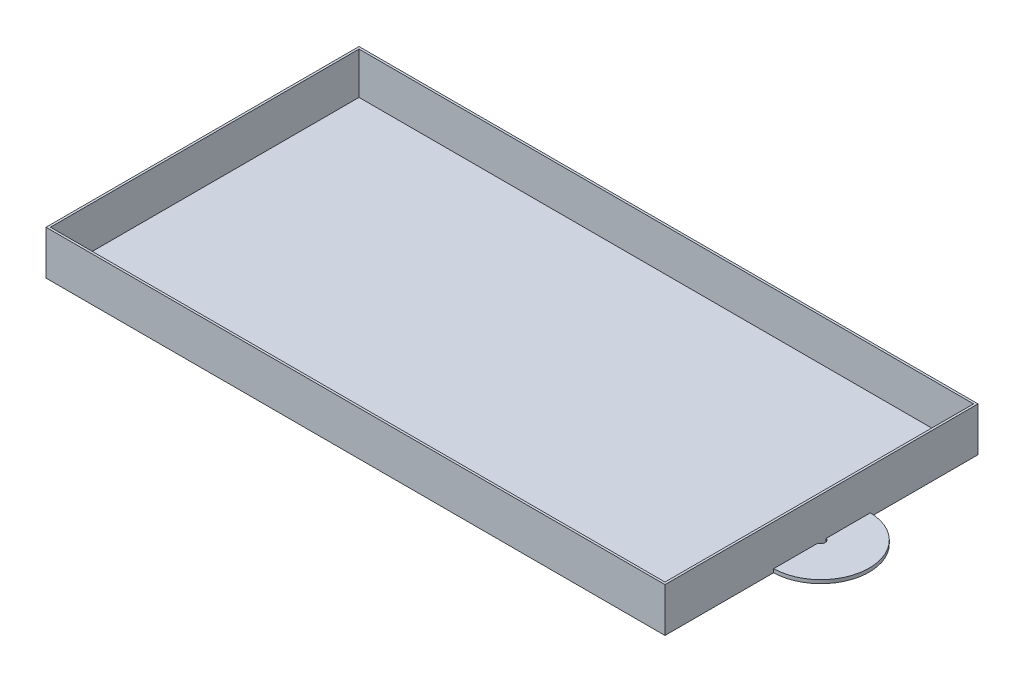
ISO-10303-21;
HEADER;
FILE_DESCRIPTION(('STEP AP214'),'2;1');
FILE_NAME('part.step','',(''),(''),'','','');
FILE_SCHEMA(('AUTOMOTIVE_DESIGN { 1 0 10303 214 1 1 1 1 }'));
ENDSEC;
DATA;
#1=APPLICATION_CONTEXT('core data for automotive mechanical design processes');
#2=APPLICATION_PROTOCOL_DEFINITION('international standard','automotive_design',2000,#1);
#3=PRODUCT_CONTEXT('',#1,'mechanical');
#4=PRODUCT('Part','Part','',(#3));
#5=PRODUCT_RELATED_PRODUCT_CATEGORY('part','',(#4));
#6=PRODUCT_DEFINITION_FORMATION('','',#4);
#7=PRODUCT_DEFINITION_CONTEXT('part definition',#1,'design');
#8=PRODUCT_DEFINITION('design','',#6,#7);
#9=PRODUCT_DEFINITION_SHAPE('','',#8);
#10=(LENGTH_UNIT() NAMED_UNIT(*) SI_UNIT(.MILLI.,.METRE.));
#11=(NAMED_UNIT(*) PLANE_ANGLE_UNIT() SI_UNIT($,.RADIAN.));
#12=(NAMED_UNIT(*) SI_UNIT($,.STERADIAN.) SOLID_ANGLE_UNIT());
#13=UNCERTAINTY_MEASURE_WITH_UNIT(LENGTH_MEASURE(1.E-05),#10,'distance_accuracy_value','');
#14=(GEOMETRIC_REPRESENTATION_CONTEXT(3) GLOBAL_UNCERTAINTY_ASSIGNED_CONTEXT((#13)) GLOBAL_UNIT_ASSIGNED_CONTEXT((#10,
#11,#12)) REPRESENTATION_CONTEXT('',''));
#15=CARTESIAN_POINT('',(0.,0.,0.));
#16=DIRECTION('',(0.,0.,1.));
#17=DIRECTION('',(1.,0.,0.));
#18=AXIS2_PLACEMENT_3D('',#15,#16,#17);
#19=CARTESIAN_POINT('',(0.,10.,-2.60735612147177));
#20=DIRECTION('',(-1.,0.,0.));
#21=DIRECTION('',(0.,0.,1.));
#22=AXIS2_PLACEMENT_3D('',#19,#20,#21);
#23=PLANE('',#22);
#24=DIRECTION('',(0.,-1.,0.));
#25=VECTOR('',#24,1.);
#26=CARTESIAN_POINT('',(0.,0.8,33.7252455357768));
#27=LINE('',#26,#25);
#28=CARTESIAN_POINT('',(0.,0.,33.7252455357768));
#29=VERTEX_POINT('',#28);
#30=CARTESIAN_POINT('',(0.,0.8,33.7252455357768));
#31=VERTEX_POINT('',#30);
#32=EDGE_CURVE('E168',#29,#31,#27,.F.);
#33=ORIENTED_EDGE('',*,*,#32,.F.);
#34=DIRECTION('',(0.,0.,-1.));
#35=VECTOR('',#34,1.);
#36=CARTESIAN_POINT('',(0.,0.,-2.60735612147177));
#37=LINE('',#36,#35);
#38=CARTESIAN_POINT('',(0.,0.,31.8363936925479));
#39=VERTEX_POINT('',#38);
#40=EDGE_CURVE('E137',#29,#39,#37,.T.);
#41=ORIENTED_EDGE('',*,*,#40,.T.);
#42=DIRECTION('',(0.,-1.,0.));
#43=VECTOR('',#42,1.);
#44=CARTESIAN_POINT('',(0.,0.8,31.8363936925479));
#45=LINE('',#44,#43);
#46=CARTESIAN_POINT('',(0.,0.8,31.8363936925479));
#47=VERTEX_POINT('',#46);
#48=EDGE_CURVE('E171',#47,#39,#45,.T.);
#49=ORIENTED_EDGE('',*,*,#48,.F.);
#50=DIRECTION('',(0.,0.,-1.));
#51=VECTOR('',#50,1.);
#52=CARTESIAN_POINT('',(0.,0.8,-2.60735612147177));
#53=LINE('',#52,#51);
#54=CARTESIAN_POINT('',(0.,0.8,21.8067122409734));
#55=VERTEX_POINT('',#54);
#56=EDGE_CURVE('E144',#47,#55,#53,.T.);
#57=ORIENTED_EDGE('',*,*,#56,.T.);
#58=DIRECTION('',(0.,-1.,0.));
#59=VECTOR('',#58,1.);
#60=CARTESIAN_POINT('',(0.,0.8,21.8067122409734));
#61=LINE('',#60,#59);
#62=CARTESIAN_POINT('',(0.,0.,21.8067122409734));
#63=VERTEX_POINT('',#62);
#64=EDGE_CURVE('E142',#55,#63,#61,.T.);
#65=ORIENTED_EDGE('',*,*,#64,.T.);
#66=CARTESIAN_POINT('',(0.,0.,-2.60735612147177));
#67=VERTEX_POINT('',#66);
#68=EDGE_CURVE('E127',#63,#67,#37,.T.);
#69=ORIENTED_EDGE('',*,*,#68,.T.);
#70=DIRECTION('',(0.,-1.,0.));
#71=VECTOR('',#70,1.);
#72=CARTESIAN_POINT('',(0.,10.,-2.60735612147177));
#73=LINE('',#72,#71);
#74=CARTESIAN_POINT('',(0.,10.,-2.60735612147177));
#75=VERTEX_POINT('',#74);
#76=EDGE_CURVE('E11',#75,#67,#73,.T.);
#77=ORIENTED_EDGE('',*,*,#76,.F.);
#78=DIRECTION('',(0.,0.,-1.));
#79=VECTOR('',#78,1.);
#80=CARTESIAN_POINT('',(0.,10.,-2.60735612147177));
#81=LINE('',#80,#79);
#82=CARTESIAN_POINT('',(0.,10.,68.3929567247595));
#83=VERTEX_POINT('',#82);
#84=EDGE_CURVE('E215',#83,#75,#81,.T.);
#85=ORIENTED_EDGE('',*,*,#84,.F.);
#86=DIRECTION('',(0.,-1.,0.));
#87=VECTOR('',#86,1.);
#88=CARTESIAN_POINT('',(0.,10.,68.3929567247595));
#89=LINE('',#88,#87);
#90=CARTESIAN_POINT('',(0.,0.,68.3929567247595));
#91=VERTEX_POINT('',#90);
#92=EDGE_CURVE('E228',#83,#91,#89,.T.);
#93=ORIENTED_EDGE('',*,*,#92,.T.);
#94=CARTESIAN_POINT('',(0.,0.,43.7549269873514));
#95=VERTEX_POINT('',#94);
#96=EDGE_CURVE('E140',#91,#95,#37,.T.);
#97=ORIENTED_EDGE('',*,*,#96,.T.);
#98=DIRECTION('',(0.,-1.,0.));
#99=VECTOR('',#98,1.);
#100=CARTESIAN_POINT('',(0.,0.8,43.7549269873514));
#101=LINE('',#100,#99);
#102=CARTESIAN_POINT('',(0.,0.8,43.7549269873514));
#103=VERTEX_POINT('',#102);
#104=EDGE_CURVE('E59',#103,#95,#101,.T.);
#105=ORIENTED_EDGE('',*,*,#104,.F.);
#106=EDGE_CURVE('E54',#103,#31,#53,.T.);
#107=ORIENTED_EDGE('',*,*,#106,.T.);
#108=EDGE_LOOP('',(#33,#41,#49,#57,#65,#69,#77,#85,#93,#97,#105,#107));
#109=FACE_BOUND('',#108,.T.);
#110=ADVANCED_FACE('F39',(#109),#23,.F.);
#111=CARTESIAN_POINT('',(0.,10.,0.));
#112=DIRECTION('',(0.,-1.,0.));
#113=DIRECTION('',(0.,0.,-1.));
#114=AXIS2_PLACEMENT_3D('',#111,#112,#113);
#115=PLANE('',#114);
#116=ORIENTED_EDGE('',*,*,#84,.T.);
#117=DIRECTION('',(-1.,0.,0.));
#118=VECTOR('',#117,1.);
#119=CARTESIAN_POINT('',(0.,10.,-2.60735612147177));
#120=LINE('',#119,#118);
#121=CARTESIAN_POINT('',(-140.39609884848,10.,-2.60735612147177));
#122=VERTEX_POINT('',#121);
#123=EDGE_CURVE('E219',#75,#122,#120,.T.);
#124=ORIENTED_EDGE('',*,*,#123,.T.);
#125=DIRECTION('',(0.,0.,1.));
#126=VECTOR('',#125,1.);
#127=CARTESIAN_POINT('',(-140.39609884848,10.,-2.60735612147177));
#128=LINE('',#127,#126);
#129=CARTESIAN_POINT('',(-140.39609884848,10.,68.3929567247595));
#130=VERTEX_POINT('',#129);
#131=EDGE_CURVE('E223',#122,#130,#128,.T.);
#132=ORIENTED_EDGE('',*,*,#131,.T.);
#133=DIRECTION('',(1.,0.,0.));
#134=VECTOR('',#133,1.);
#135=CARTESIAN_POINT('',(0.,10.,68.3929567247595));
#136=LINE('',#135,#134);
#137=EDGE_CURVE('E226',#130,#83,#136,.T.);
#138=ORIENTED_EDGE('',*,*,#137,.T.);
#139=EDGE_LOOP('',(#116,#124,#132,#138));
#140=FACE_BOUND('',#139,.T.);
#141=DIRECTION('',(0.,0.,-1.));
#142=VECTOR('',#141,1.);
#143=CARTESIAN_POINT('',(-0.5,10.,0.));
#144=LINE('',#143,#142);
#145=CARTESIAN_POINT('',(-0.5,10.,67.8929567247595));
#146=VERTEX_POINT('',#145);
#147=CARTESIAN_POINT('',(-0.5,10.,-2.10735612147177));
#148=VERTEX_POINT('',#147);
#149=EDGE_CURVE('E203',#146,#148,#144,.T.);
#150=ORIENTED_EDGE('',*,*,#149,.F.);
#151=DIRECTION('',(1.,0.,0.));
#152=VECTOR('',#151,1.);
#153=CARTESIAN_POINT('',(0.,10.,67.8929567247595));
#154=LINE('',#153,#152);
#155=CARTESIAN_POINT('',(-139.89609884848,10.,67.8929567247595));
#156=VERTEX_POINT('',#155);
#157=EDGE_CURVE('E188',#156,#146,#154,.T.);
#158=ORIENTED_EDGE('',*,*,#157,.F.);
#159=DIRECTION('',(0.,0.,1.));
#160=VECTOR('',#159,1.);
#161=CARTESIAN_POINT('',(-139.89609884848,10.,0.));
#162=LINE('',#161,#160);
#163=CARTESIAN_POINT('',(-139.89609884848,10.,-2.10735612147177));
#164=VERTEX_POINT('',#163);
#165=EDGE_CURVE('E209',#164,#156,#162,.T.);
#166=ORIENTED_EDGE('',*,*,#165,.F.);
#167=DIRECTION('',(-1.,0.,0.));
#168=VECTOR('',#167,1.);
#169=CARTESIAN_POINT('',(0.,10.,-2.10735612147177));
#170=LINE('',#169,#168);
#171=EDGE_CURVE('E206',#148,#164,#170,.T.);
#172=ORIENTED_EDGE('',*,*,#171,.F.);
#173=EDGE_LOOP('',(#150,#158,#166,#172));
#174=FACE_BOUND('',#173,.T.);
#175=ADVANCED_FACE('F259',(#140,#174),#115,.F.);
#176=CARTESIAN_POINT('',(0.,10.,-2.60735612147177));
#177=DIRECTION('',(0.,0.,1.));
#178=DIRECTION('',(1.,0.,0.));
#179=AXIS2_PLACEMENT_3D('',#176,#177,#178);
#180=PLANE('',#179);
#181=DIRECTION('',(-1.,0.,0.));
#182=VECTOR('',#181,1.);
#183=CARTESIAN_POINT('',(0.,0.,-2.60735612147177));
#184=LINE('',#183,#182);
#185=CARTESIAN_POINT('',(-140.39609884848,0.,-2.60735612147177));
#186=VERTEX_POINT('',#185);
#187=EDGE_CURVE('E134',#67,#186,#184,.T.);
#188=ORIENTED_EDGE('',*,*,#187,.T.);
#189=DIRECTION('',(0.,-1.,0.));
#190=VECTOR('',#189,1.);
#191=CARTESIAN_POINT('',(-140.39609884848,10.,-2.60735612147177));
#192=LINE('',#191,#190);
#193=EDGE_CURVE('E47',#122,#186,#192,.T.);
#194=ORIENTED_EDGE('',*,*,#193,.F.);
#195=ORIENTED_EDGE('',*,*,#123,.F.);
#196=ORIENTED_EDGE('',*,*,#76,.T.);
#197=EDGE_LOOP('',(#188,#194,#195,#196));
#198=FACE_BOUND('',#197,.T.);
#199=ADVANCED_FACE('F261',(#198),#180,.F.);
#200=CARTESIAN_POINT('',(-140.39609884848,10.,-2.60735612147177));
#201=DIRECTION('',(1.,0.,0.));
#202=DIRECTION('',(0.,0.,-1.));
#203=AXIS2_PLACEMENT_3D('',#200,#201,#202);
#204=PLANE('',#203);
#205=DIRECTION('',(0.,0.,1.));
#206=VECTOR('',#205,1.);
#207=CARTESIAN_POINT('',(-140.39609884848,0.,-2.60735612147177));
#208=LINE('',#207,#206);
#209=CARTESIAN_POINT('',(-140.39609884848,0.,68.3929567247595));
#210=VERTEX_POINT('',#209);
#211=EDGE_CURVE('E233',#186,#210,#208,.T.);
#212=ORIENTED_EDGE('',*,*,#211,.T.);
#213=DIRECTION('',(0.,-1.,0.));
#214=VECTOR('',#213,1.);
#215=CARTESIAN_POINT('',(-140.39609884848,10.,68.3929567247595));
#216=LINE('',#215,#214);
#217=EDGE_CURVE('E241',#130,#210,#216,.T.);
#218=ORIENTED_EDGE('',*,*,#217,.F.);
#219=ORIENTED_EDGE('',*,*,#131,.F.);
#220=ORIENTED_EDGE('',*,*,#193,.T.);
#221=EDGE_LOOP('',(#212,#218,#219,#220));
#222=FACE_BOUND('',#221,.T.);
#223=ADVANCED_FACE('F249',(#222),#204,.F.);
#224=CARTESIAN_POINT('',(0.,10.,68.3929567247595));
#225=DIRECTION('',(0.,0.,-1.));
#226=DIRECTION('',(-1.,0.,0.));
#227=AXIS2_PLACEMENT_3D('',#224,#225,#226);
#228=PLANE('',#227);
#229=DIRECTION('',(1.,0.,0.));
#230=VECTOR('',#229,1.);
#231=CARTESIAN_POINT('',(0.,0.,68.3929567247595));
#232=LINE('',#231,#230);
#233=EDGE_CURVE('E220',#210,#91,#232,.T.);
#234=ORIENTED_EDGE('',*,*,#233,.T.);
#235=ORIENTED_EDGE('',*,*,#92,.F.);
#236=ORIENTED_EDGE('',*,*,#137,.F.);
#237=ORIENTED_EDGE('',*,*,#217,.T.);
#238=EDGE_LOOP('',(#234,#235,#236,#237));
#239=FACE_BOUND('',#238,.T.);
#240=ADVANCED_FACE('F255',(#239),#228,.F.);
#241=CARTESIAN_POINT('',(0.,0.,0.));
#242=DIRECTION('',(0.,-1.,0.));
#243=DIRECTION('',(0.,0.,-1.));
#244=AXIS2_PLACEMENT_3D('',#241,#242,#243);
#245=PLANE('',#244);
#246=ORIENTED_EDGE('',*,*,#40,.F.);
#247=CARTESIAN_POINT('',(-0.249999999999999,0.,32.7808196141624));
#248=DIRECTION('',(0.,1.,0.));
#249=DIRECTION('',(1.,0.,0.));
#250=AXIS2_PLACEMENT_3D('',#247,#248,#249);
#251=CIRCLE('',#250,0.976954615843175);
#252=EDGE_CURVE('E153',#39,#29,#251,.F.);
#253=ORIENTED_EDGE('',*,*,#252,.F.);
#254=EDGE_LOOP('',(#246,#253));
#255=FACE_BOUND('',#254,.T.);
#256=ORIENTED_EDGE('',*,*,#68,.F.);
#257=CARTESIAN_POINT('',(-0.249999999999999,0.,32.7808196141624));
#258=DIRECTION('',(0.,-1.,0.));
#259=DIRECTION('',(0.,0.,-1.));
#260=AXIS2_PLACEMENT_3D('',#257,#258,#259);
#261=CIRCLE('',#260,10.9769546158432);
#262=EDGE_CURVE('E132',#63,#95,#261,.T.);
#263=ORIENTED_EDGE('',*,*,#262,.T.);
#264=ORIENTED_EDGE('',*,*,#96,.F.);
#265=ORIENTED_EDGE('',*,*,#233,.F.);
#266=ORIENTED_EDGE('',*,*,#211,.F.);
#267=ORIENTED_EDGE('',*,*,#187,.F.);
#268=EDGE_LOOP('',(#256,#263,#264,#265,#266,#267));
#269=FACE_BOUND('',#268,.T.);
#270=ADVANCED_FACE('F129',(#255,#269),#245,.T.);
#271=CARTESIAN_POINT('',(-0.5,10.,-2.60735612147177));
#272=DIRECTION('',(-1.,0.,0.));
#273=DIRECTION('',(0.,0.,1.));
#274=AXIS2_PLACEMENT_3D('',#271,#272,#273);
#275=PLANE('',#274);
#276=DIRECTION('',(0.,0.,-1.));
#277=VECTOR('',#276,1.);
#278=CARTESIAN_POINT('',(-0.5,0.5,0.));
#279=LINE('',#278,#277);
#280=CARTESIAN_POINT('',(-0.5,0.5,67.8929567247595));
#281=VERTEX_POINT('',#280);
#282=CARTESIAN_POINT('',(-0.5,0.5,-2.10735612147177));
#283=VERTEX_POINT('',#282);
#284=EDGE_CURVE('E175',#281,#283,#279,.T.);
#285=ORIENTED_EDGE('',*,*,#284,.F.);
#286=DIRECTION('',(0.,-1.,0.));
#287=VECTOR('',#286,1.);
#288=CARTESIAN_POINT('',(-0.5,10.,67.8929567247595));
#289=LINE('',#288,#287);
#290=EDGE_CURVE('E183',#146,#281,#289,.T.);
#291=ORIENTED_EDGE('',*,*,#290,.F.);
#292=ORIENTED_EDGE('',*,*,#149,.T.);
#293=DIRECTION('',(0.,-1.,0.));
#294=VECTOR('',#293,1.);
#295=CARTESIAN_POINT('',(-0.5,10.,-2.10735612147177));
#296=LINE('',#295,#294);
#297=EDGE_CURVE('E138',#148,#283,#296,.T.);
#298=ORIENTED_EDGE('',*,*,#297,.T.);
#299=EDGE_LOOP('',(#285,#291,#292,#298));
#300=FACE_BOUND('',#299,.T.);
#301=ADVANCED_FACE('F296',(#300),#275,.T.);
#302=CARTESIAN_POINT('',(0.,10.,-2.10735612147177));
#303=DIRECTION('',(0.,0.,1.));
#304=DIRECTION('',(1.,0.,0.));
#305=AXIS2_PLACEMENT_3D('',#302,#303,#304);
#306=PLANE('',#305);
#307=DIRECTION('',(-1.,0.,0.));
#308=VECTOR('',#307,1.);
#309=CARTESIAN_POINT('',(0.,0.5,-2.10735612147177));
#310=LINE('',#309,#308);
#311=CARTESIAN_POINT('',(-139.89609884848,0.5,-2.10735612147177));
#312=VERTEX_POINT('',#311);
#313=EDGE_CURVE('E178',#283,#312,#310,.T.);
#314=ORIENTED_EDGE('',*,*,#313,.F.);
#315=ORIENTED_EDGE('',*,*,#297,.F.);
#316=ORIENTED_EDGE('',*,*,#171,.T.);
#317=DIRECTION('',(0.,-1.,0.));
#318=VECTOR('',#317,1.);
#319=CARTESIAN_POINT('',(-139.89609884848,10.,-2.10735612147177));
#320=LINE('',#319,#318);
#321=EDGE_CURVE('E182',#164,#312,#320,.T.);
#322=ORIENTED_EDGE('',*,*,#321,.T.);
#323=EDGE_LOOP('',(#314,#315,#316,#322));
#324=FACE_BOUND('',#323,.T.);
#325=ADVANCED_FACE('F290',(#324),#306,.T.);
#326=CARTESIAN_POINT('',(-139.89609884848,10.,-2.60735612147177));
#327=DIRECTION('',(1.,0.,0.));
#328=DIRECTION('',(0.,0.,-1.));
#329=AXIS2_PLACEMENT_3D('',#326,#327,#328);
#330=PLANE('',#329);
#331=DIRECTION('',(0.,0.,1.));
#332=VECTOR('',#331,1.);
#333=CARTESIAN_POINT('',(-139.89609884848,0.5,0.));
#334=LINE('',#333,#332);
#335=CARTESIAN_POINT('',(-139.89609884848,0.5,67.8929567247595));
#336=VERTEX_POINT('',#335);
#337=EDGE_CURVE('E191',#312,#336,#334,.T.);
#338=ORIENTED_EDGE('',*,*,#337,.F.);
#339=ORIENTED_EDGE('',*,*,#321,.F.);
#340=ORIENTED_EDGE('',*,*,#165,.T.);
#341=DIRECTION('',(0.,-1.,0.));
#342=VECTOR('',#341,1.);
#343=CARTESIAN_POINT('',(-139.89609884848,10.,67.8929567247595));
#344=LINE('',#343,#342);
#345=EDGE_CURVE('E187',#156,#336,#344,.T.);
#346=ORIENTED_EDGE('',*,*,#345,.T.);
#347=EDGE_LOOP('',(#338,#339,#340,#346));
#348=FACE_BOUND('',#347,.T.);
#349=ADVANCED_FACE('F295',(#348),#330,.T.);
#350=CARTESIAN_POINT('',(0.,10.,67.8929567247595));
#351=DIRECTION('',(0.,0.,-1.));
#352=DIRECTION('',(-1.,0.,0.));
#353=AXIS2_PLACEMENT_3D('',#350,#351,#352);
#354=PLANE('',#353);
#355=DIRECTION('',(1.,0.,0.));
#356=VECTOR('',#355,1.);
#357=CARTESIAN_POINT('',(0.,0.5,67.8929567247595));
#358=LINE('',#357,#356);
#359=EDGE_CURVE('E197',#336,#281,#358,.T.);
#360=ORIENTED_EDGE('',*,*,#359,.F.);
#361=ORIENTED_EDGE('',*,*,#345,.F.);
#362=ORIENTED_EDGE('',*,*,#157,.T.);
#363=ORIENTED_EDGE('',*,*,#290,.T.);
#364=EDGE_LOOP('',(#360,#361,#362,#363));
#365=FACE_BOUND('',#364,.T.);
#366=ADVANCED_FACE('F306',(#365),#354,.T.);
#367=CARTESIAN_POINT('',(0.,0.5,0.));
#368=DIRECTION('',(0.,-1.,0.));
#369=DIRECTION('',(0.,0.,-1.));
#370=AXIS2_PLACEMENT_3D('',#367,#368,#369);
#371=PLANE('',#370);
#372=ORIENTED_EDGE('',*,*,#284,.T.);
#373=ORIENTED_EDGE('',*,*,#313,.T.);
#374=ORIENTED_EDGE('',*,*,#337,.T.);
#375=ORIENTED_EDGE('',*,*,#359,.T.);
#376=EDGE_LOOP('',(#372,#373,#374,#375));
#377=FACE_BOUND('',#376,.T.);
#378=ADVANCED_FACE('F315',(#377),#371,.F.);
#379=CARTESIAN_POINT('',(-0.249999999999999,0.8,32.7808196141624));
#380=DIRECTION('',(0.,-1.,0.));
#381=DIRECTION('',(0.,0.,-1.));
#382=AXIS2_PLACEMENT_3D('',#379,#380,#381);
#383=CYLINDRICAL_SURFACE('',#382,0.976954615843175);
#384=CARTESIAN_POINT('',(-0.249999999999999,0.8,32.7808196141624));
#385=DIRECTION('',(0.,1.,0.));
#386=DIRECTION('',(1.,0.,0.));
#387=AXIS2_PLACEMENT_3D('',#384,#385,#386);
#388=CIRCLE('',#387,0.976954615843175);
#389=EDGE_CURVE('E152',#47,#31,#388,.F.);
#390=ORIENTED_EDGE('',*,*,#389,.F.);
#391=ORIENTED_EDGE('',*,*,#48,.T.);
#392=ORIENTED_EDGE('',*,*,#252,.T.);
#393=ORIENTED_EDGE('',*,*,#32,.T.);
#394=EDGE_LOOP('',(#390,#391,#392,#393));
#395=FACE_BOUND('',#394,.T.);
#396=ADVANCED_FACE('F326',(#395),#383,.F.);
#397=CARTESIAN_POINT('',(-0.249999999999999,0.8,32.7808196141624));
#398=DIRECTION('',(0.,1.,0.));
#399=DIRECTION('',(1.,0.,0.));
#400=AXIS2_PLACEMENT_3D('',#397,#398,#399);
#401=PLANE('',#400);
#402=ORIENTED_EDGE('',*,*,#106,.F.);
#403=CARTESIAN_POINT('',(-0.249999999999999,0.8,32.7808196141624));
#404=DIRECTION('',(0.,-1.,0.));
#405=DIRECTION('',(0.,0.,-1.));
#406=AXIS2_PLACEMENT_3D('',#403,#404,#405);
#407=CIRCLE('',#406,10.9769546158432);
#408=EDGE_CURVE('E158',#55,#103,#407,.T.);
#409=ORIENTED_EDGE('',*,*,#408,.F.);
#410=ORIENTED_EDGE('',*,*,#56,.F.);
#411=ORIENTED_EDGE('',*,*,#389,.T.);
#412=EDGE_LOOP('',(#402,#409,#410,#411));
#413=FACE_BOUND('',#412,.T.);
#414=ADVANCED_FACE('F334',(#413),#401,.T.);
#415=CARTESIAN_POINT('',(-0.249999999999999,0.8,32.7808196141624));
#416=DIRECTION('',(0.,-1.,0.));
#417=DIRECTION('',(0.,0.,-1.));
#418=AXIS2_PLACEMENT_3D('',#415,#416,#417);
#419=CYLINDRICAL_SURFACE('',#418,10.9769546158432);
#420=ORIENTED_EDGE('',*,*,#64,.F.);
#421=ORIENTED_EDGE('',*,*,#408,.T.);
#422=ORIENTED_EDGE('',*,*,#104,.T.);
#423=ORIENTED_EDGE('',*,*,#262,.F.);
#424=EDGE_LOOP('',(#420,#421,#422,#423));
#425=FACE_BOUND('',#424,.T.);
#426=ADVANCED_FACE('F150',(#425),#419,.T.);
#427=CLOSED_SHELL('',(#110,#175,#199,#223,#240,#270,#301,#325,#349,#366,#378,#396,#414,#426));
#428=MANIFOLD_SOLID_BREP('B2',#427);
#429=ADVANCED_BREP_SHAPE_REPRESENTATION('',(#18,#428),#14);
#430=SHAPE_DEFINITION_REPRESENTATION(#9,#429);
ENDSEC;
END-ISO-10303-21;
